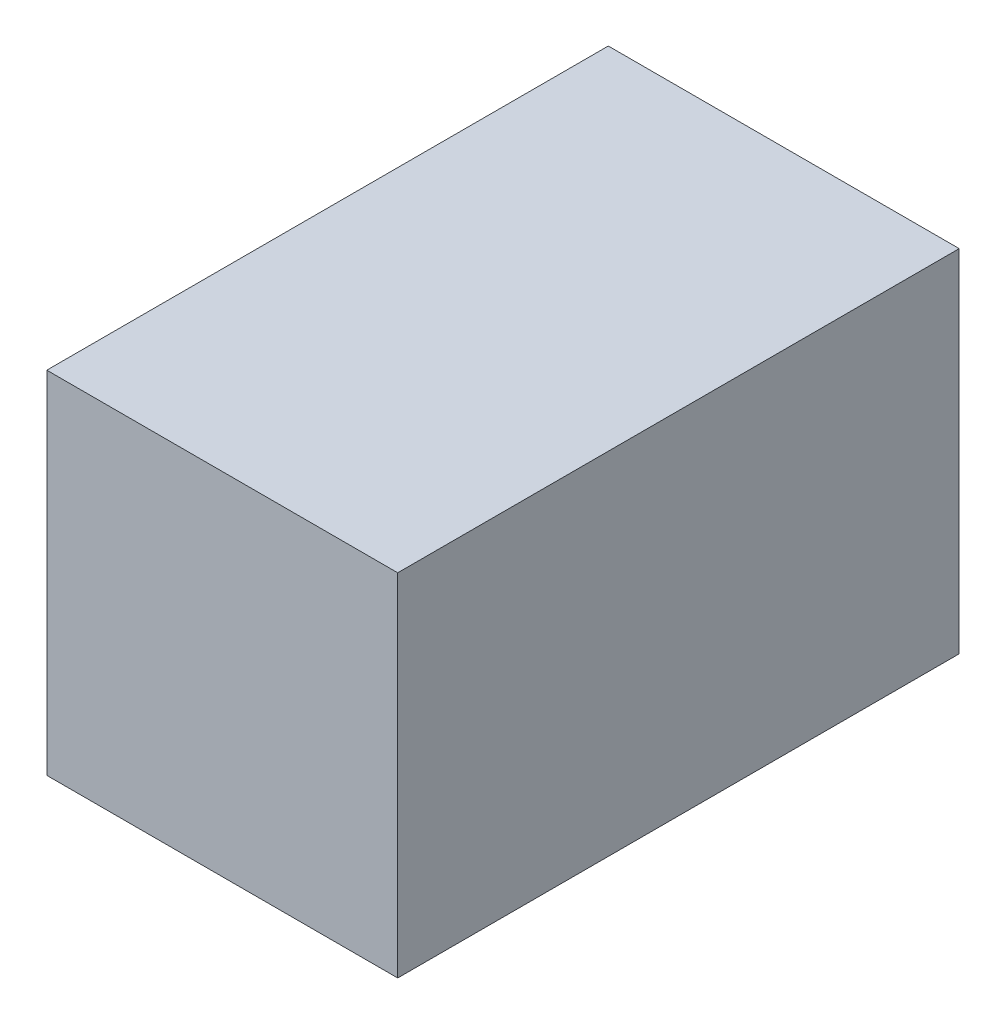
ISO-10303-21;
HEADER;
FILE_DESCRIPTION(('STEP AP214'),'2;1');
FILE_NAME('part.step','',(''),(''),'','','');
FILE_SCHEMA(('AUTOMOTIVE_DESIGN { 1 0 10303 214 1 1 1 1 }'));
ENDSEC;
DATA;
#1=APPLICATION_CONTEXT('core data for automotive mechanical design processes');
#2=APPLICATION_PROTOCOL_DEFINITION('international standard','automotive_design',2000,#1);
#3=PRODUCT_CONTEXT('',#1,'mechanical');
#4=PRODUCT('Part','Part','',(#3));
#5=PRODUCT_RELATED_PRODUCT_CATEGORY('part','',(#4));
#6=PRODUCT_DEFINITION_FORMATION('','',#4);
#7=PRODUCT_DEFINITION_CONTEXT('part definition',#1,'design');
#8=PRODUCT_DEFINITION('design','',#6,#7);
#9=PRODUCT_DEFINITION_SHAPE('','',#8);
#10=(LENGTH_UNIT() NAMED_UNIT(*) SI_UNIT(.MILLI.,.METRE.));
#11=(NAMED_UNIT(*) PLANE_ANGLE_UNIT() SI_UNIT($,.RADIAN.));
#12=(NAMED_UNIT(*) SI_UNIT($,.STERADIAN.) SOLID_ANGLE_UNIT());
#13=UNCERTAINTY_MEASURE_WITH_UNIT(LENGTH_MEASURE(1.E-05),#10,'distance_accuracy_value','');
#14=(GEOMETRIC_REPRESENTATION_CONTEXT(3) GLOBAL_UNCERTAINTY_ASSIGNED_CONTEXT((#13)) GLOBAL_UNIT_ASSIGNED_CONTEXT((#10,
#11,#12)) REPRESENTATION_CONTEXT('',''));
#15=CARTESIAN_POINT('',(0.,0.,0.));
#16=DIRECTION('',(0.,0.,1.));
#17=DIRECTION('',(1.,0.,0.));
#18=AXIS2_PLACEMENT_3D('',#15,#16,#17);
#19=CARTESIAN_POINT('',(31.75,63.5,-50.8));
#20=DIRECTION('',(-1.,0.,0.));
#21=DIRECTION('',(0.,0.,1.));
#22=AXIS2_PLACEMENT_3D('',#19,#20,#21);
#23=PLANE('',#22);
#24=DIRECTION('',(0.,0.,-1.));
#25=VECTOR('',#24,1.);
#26=CARTESIAN_POINT('',(31.75,0.,-50.8));
#27=LINE('',#26,#25);
#28=CARTESIAN_POINT('',(31.75,0.,50.8));
#29=VERTEX_POINT('',#28);
#30=CARTESIAN_POINT('',(31.75,0.,-50.8));
#31=VERTEX_POINT('',#30);
#32=EDGE_CURVE('E97',#29,#31,#27,.T.);
#33=ORIENTED_EDGE('',*,*,#32,.T.);
#34=DIRECTION('',(0.,-1.,0.));
#35=VECTOR('',#34,1.);
#36=CARTESIAN_POINT('',(31.75,63.5,-50.8));
#37=LINE('',#36,#35);
#38=CARTESIAN_POINT('',(31.75,63.5,-50.8));
#39=VERTEX_POINT('',#38);
#40=EDGE_CURVE('E11',#39,#31,#37,.T.);
#41=ORIENTED_EDGE('',*,*,#40,.F.);
#42=DIRECTION('',(0.,0.,-1.));
#43=VECTOR('',#42,1.);
#44=CARTESIAN_POINT('',(31.75,63.5,-50.8));
#45=LINE('',#44,#43);
#46=CARTESIAN_POINT('',(31.75,63.5,50.8));
#47=VERTEX_POINT('',#46);
#48=EDGE_CURVE('E85',#47,#39,#45,.T.);
#49=ORIENTED_EDGE('',*,*,#48,.F.);
#50=DIRECTION('',(0.,-1.,0.));
#51=VECTOR('',#50,1.);
#52=CARTESIAN_POINT('',(31.75,63.5,50.8));
#53=LINE('',#52,#51);
#54=EDGE_CURVE('E93',#47,#29,#53,.T.);
#55=ORIENTED_EDGE('',*,*,#54,.T.);
#56=EDGE_LOOP('',(#33,#41,#49,#55));
#57=FACE_BOUND('',#56,.T.);
#58=ADVANCED_FACE('F34',(#57),#23,.F.);
#59=CARTESIAN_POINT('',(-31.75,63.5,-50.8));
#60=DIRECTION('',(0.,0.,1.));
#61=DIRECTION('',(1.,0.,0.));
#62=AXIS2_PLACEMENT_3D('',#59,#60,#61);
#63=PLANE('',#62);
#64=DIRECTION('',(-1.,0.,0.));
#65=VECTOR('',#64,1.);
#66=CARTESIAN_POINT('',(-31.75,0.,-50.8));
#67=LINE('',#66,#65);
#68=CARTESIAN_POINT('',(-31.75,0.,-50.8));
#69=VERTEX_POINT('',#68);
#70=EDGE_CURVE('E89',#31,#69,#67,.T.);
#71=ORIENTED_EDGE('',*,*,#70,.T.);
#72=DIRECTION('',(0.,-1.,0.));
#73=VECTOR('',#72,1.);
#74=CARTESIAN_POINT('',(-31.75,63.5,-50.8));
#75=LINE('',#74,#73);
#76=CARTESIAN_POINT('',(-31.75,63.5,-50.8));
#77=VERTEX_POINT('',#76);
#78=EDGE_CURVE('E42',#77,#69,#75,.T.);
#79=ORIENTED_EDGE('',*,*,#78,.F.);
#80=DIRECTION('',(-1.,0.,0.));
#81=VECTOR('',#80,1.);
#82=CARTESIAN_POINT('',(-31.75,63.5,-50.8));
#83=LINE('',#82,#81);
#84=EDGE_CURVE('E80',#39,#77,#83,.T.);
#85=ORIENTED_EDGE('',*,*,#84,.F.);
#86=ORIENTED_EDGE('',*,*,#40,.T.);
#87=EDGE_LOOP('',(#71,#79,#85,#86));
#88=FACE_BOUND('',#87,.T.);
#89=ADVANCED_FACE('F88',(#88),#63,.F.);
#90=CARTESIAN_POINT('',(-31.75,63.5,-50.8));
#91=DIRECTION('',(1.,0.,0.));
#92=DIRECTION('',(0.,0.,-1.));
#93=AXIS2_PLACEMENT_3D('',#90,#91,#92);
#94=PLANE('',#93);
#95=DIRECTION('',(0.,0.,1.));
#96=VECTOR('',#95,1.);
#97=CARTESIAN_POINT('',(-31.75,0.,-50.8));
#98=LINE('',#97,#96);
#99=CARTESIAN_POINT('',(-31.75,0.,50.8));
#100=VERTEX_POINT('',#99);
#101=EDGE_CURVE('E67',#69,#100,#98,.T.);
#102=ORIENTED_EDGE('',*,*,#101,.T.);
#103=DIRECTION('',(0.,-1.,0.));
#104=VECTOR('',#103,1.);
#105=CARTESIAN_POINT('',(-31.75,63.5,50.8));
#106=LINE('',#105,#104);
#107=CARTESIAN_POINT('',(-31.75,63.5,50.8));
#108=VERTEX_POINT('',#107);
#109=EDGE_CURVE('E90',#108,#100,#106,.T.);
#110=ORIENTED_EDGE('',*,*,#109,.F.);
#111=DIRECTION('',(0.,0.,1.));
#112=VECTOR('',#111,1.);
#113=CARTESIAN_POINT('',(-31.75,63.5,-50.8));
#114=LINE('',#113,#112);
#115=EDGE_CURVE('E83',#77,#108,#114,.T.);
#116=ORIENTED_EDGE('',*,*,#115,.F.);
#117=ORIENTED_EDGE('',*,*,#78,.T.);
#118=EDGE_LOOP('',(#102,#110,#116,#117));
#119=FACE_BOUND('',#118,.T.);
#120=ADVANCED_FACE('F91',(#119),#94,.F.);
#121=CARTESIAN_POINT('',(-31.75,63.5,50.8));
#122=DIRECTION('',(0.,0.,-1.));
#123=DIRECTION('',(-1.,0.,0.));
#124=AXIS2_PLACEMENT_3D('',#121,#122,#123);
#125=PLANE('',#124);
#126=DIRECTION('',(1.,0.,0.));
#127=VECTOR('',#126,1.);
#128=CARTESIAN_POINT('',(-31.75,0.,50.8));
#129=LINE('',#128,#127);
#130=EDGE_CURVE('E73',#100,#29,#129,.T.);
#131=ORIENTED_EDGE('',*,*,#130,.T.);
#132=ORIENTED_EDGE('',*,*,#54,.F.);
#133=DIRECTION('',(1.,0.,0.));
#134=VECTOR('',#133,1.);
#135=CARTESIAN_POINT('',(-31.75,63.5,50.8));
#136=LINE('',#135,#134);
#137=EDGE_CURVE('E50',#108,#47,#136,.T.);
#138=ORIENTED_EDGE('',*,*,#137,.F.);
#139=ORIENTED_EDGE('',*,*,#109,.T.);
#140=EDGE_LOOP('',(#131,#132,#138,#139));
#141=FACE_BOUND('',#140,.T.);
#142=ADVANCED_FACE('F104',(#141),#125,.F.);
#143=CARTESIAN_POINT('',(0.,63.5,0.));
#144=DIRECTION('',(0.,1.,0.));
#145=DIRECTION('',(0.,0.,1.));
#146=AXIS2_PLACEMENT_3D('',#143,#144,#145);
#147=PLANE('',#146);
#148=ORIENTED_EDGE('',*,*,#48,.T.);
#149=ORIENTED_EDGE('',*,*,#84,.T.);
#150=ORIENTED_EDGE('',*,*,#115,.T.);
#151=ORIENTED_EDGE('',*,*,#137,.T.);
#152=EDGE_LOOP('',(#148,#149,#150,#151));
#153=FACE_BOUND('',#152,.T.);
#154=ADVANCED_FACE('F81',(#153),#147,.T.);
#155=CARTESIAN_POINT('',(0.,0.,0.));
#156=DIRECTION('',(0.,1.,0.));
#157=DIRECTION('',(0.,0.,1.));
#158=AXIS2_PLACEMENT_3D('',#155,#156,#157);
#159=PLANE('',#158);
#160=ORIENTED_EDGE('',*,*,#32,.F.);
#161=ORIENTED_EDGE('',*,*,#130,.F.);
#162=ORIENTED_EDGE('',*,*,#101,.F.);
#163=ORIENTED_EDGE('',*,*,#70,.F.);
#164=EDGE_LOOP('',(#160,#161,#162,#163));
#165=FACE_BOUND('',#164,.T.);
#166=ADVANCED_FACE('F107',(#165),#159,.F.);
#167=CLOSED_SHELL('',(#58,#89,#120,#142,#154,#166));
#168=MANIFOLD_SOLID_BREP('B2',#167);
#169=ADVANCED_BREP_SHAPE_REPRESENTATION('',(#18,#168),#14);
#170=SHAPE_DEFINITION_REPRESENTATION(#9,#169);
ENDSEC;
END-ISO-10303-21;
